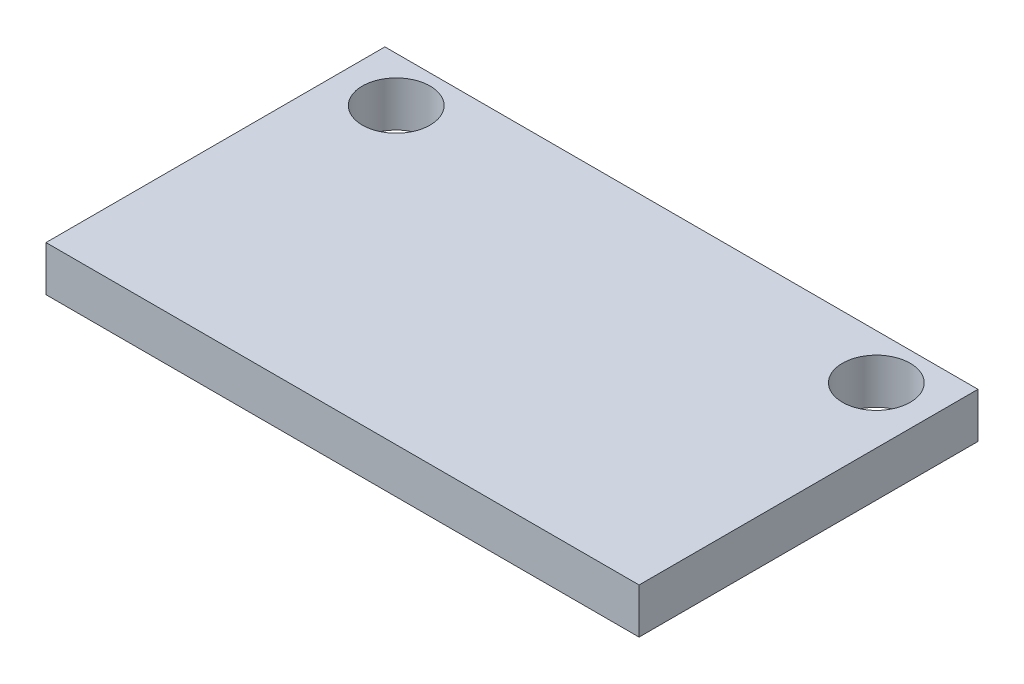
ISO-10303-21;
HEADER;
FILE_DESCRIPTION(('STEP AP214'),'2;1');
FILE_NAME('part.step','',(''),(''),'','','');
FILE_SCHEMA(('AUTOMOTIVE_DESIGN { 1 0 10303 214 1 1 1 1 }'));
ENDSEC;
DATA;
#1=APPLICATION_CONTEXT('core data for automotive mechanical design processes');
#2=APPLICATION_PROTOCOL_DEFINITION('international standard','automotive_design',2000,#1);
#3=PRODUCT_CONTEXT('',#1,'mechanical');
#4=PRODUCT('Part','Part','',(#3));
#5=PRODUCT_RELATED_PRODUCT_CATEGORY('part','',(#4));
#6=PRODUCT_DEFINITION_FORMATION('','',#4);
#7=PRODUCT_DEFINITION_CONTEXT('part definition',#1,'design');
#8=PRODUCT_DEFINITION('design','',#6,#7);
#9=PRODUCT_DEFINITION_SHAPE('','',#8);
#10=(LENGTH_UNIT() NAMED_UNIT(*) SI_UNIT(.MILLI.,.METRE.));
#11=(NAMED_UNIT(*) PLANE_ANGLE_UNIT() SI_UNIT($,.RADIAN.));
#12=(NAMED_UNIT(*) SI_UNIT($,.STERADIAN.) SOLID_ANGLE_UNIT());
#13=UNCERTAINTY_MEASURE_WITH_UNIT(LENGTH_MEASURE(1.E-05),#10,'distance_accuracy_value','');
#14=(GEOMETRIC_REPRESENTATION_CONTEXT(3) GLOBAL_UNCERTAINTY_ASSIGNED_CONTEXT((#13)) GLOBAL_UNIT_ASSIGNED_CONTEXT((#10,
#11,#12)) REPRESENTATION_CONTEXT('',''));
#15=CARTESIAN_POINT('',(0.,0.,0.));
#16=DIRECTION('',(0.,0.,1.));
#17=DIRECTION('',(1.,0.,0.));
#18=AXIS2_PLACEMENT_3D('',#15,#16,#17);
#19=CARTESIAN_POINT('',(0.,1.,0.));
#20=DIRECTION('',(0.,1.,0.));
#21=DIRECTION('',(0.,0.,1.));
#22=AXIS2_PLACEMENT_3D('',#19,#20,#21);
#23=PLANE('',#22);
#24=CARTESIAN_POINT('',(-10.625,1.,-5.5));
#25=DIRECTION('',(0.,1.,0.));
#26=DIRECTION('',(0.,0.,1.));
#27=AXIS2_PLACEMENT_3D('',#24,#25,#26);
#28=CIRCLE('',#27,1.5);
#29=CARTESIAN_POINT('',(-10.625,1.,-4.));
#30=VERTEX_POINT('',#29);
#31=EDGE_CURVE('E100',#30,#30,#28,.T.);
#32=ORIENTED_EDGE('',*,*,#31,.F.);
#33=EDGE_LOOP('',(#32));
#34=FACE_BOUND('',#33,.T.);
#35=DIRECTION('',(0.,0.,-1.));
#36=VECTOR('',#35,1.);
#37=CARTESIAN_POINT('',(13.125,1.,-7.5));
#38=LINE('',#37,#36);
#39=CARTESIAN_POINT('',(13.125,1.,7.5));
#40=VERTEX_POINT('',#39);
#41=CARTESIAN_POINT('',(13.125,1.,-7.5));
#42=VERTEX_POINT('',#41);
#43=EDGE_CURVE('E85',#40,#42,#38,.T.);
#44=ORIENTED_EDGE('',*,*,#43,.T.);
#45=DIRECTION('',(-1.,0.,0.));
#46=VECTOR('',#45,1.);
#47=CARTESIAN_POINT('',(-13.125,1.,-7.5));
#48=LINE('',#47,#46);
#49=CARTESIAN_POINT('',(-13.125,1.,-7.5));
#50=VERTEX_POINT('',#49);
#51=EDGE_CURVE('E80',#42,#50,#48,.T.);
#52=ORIENTED_EDGE('',*,*,#51,.T.);
#53=DIRECTION('',(0.,0.,1.));
#54=VECTOR('',#53,1.);
#55=CARTESIAN_POINT('',(-13.125,1.,-7.5));
#56=LINE('',#55,#54);
#57=CARTESIAN_POINT('',(-13.125,1.,7.5));
#58=VERTEX_POINT('',#57);
#59=EDGE_CURVE('E83',#50,#58,#56,.T.);
#60=ORIENTED_EDGE('',*,*,#59,.T.);
#61=DIRECTION('',(1.,0.,0.));
#62=VECTOR('',#61,1.);
#63=CARTESIAN_POINT('',(-13.125,1.,7.5));
#64=LINE('',#63,#62);
#65=EDGE_CURVE('E50',#58,#40,#64,.T.);
#66=ORIENTED_EDGE('',*,*,#65,.T.);
#67=EDGE_LOOP('',(#44,#52,#60,#66));
#68=FACE_BOUND('',#67,.T.);
#69=CARTESIAN_POINT('',(10.625,1.,-5.5));
#70=DIRECTION('',(0.,1.,0.));
#71=DIRECTION('',(0.,0.,1.));
#72=AXIS2_PLACEMENT_3D('',#69,#70,#71);
#73=CIRCLE('',#72,1.5);
#74=CARTESIAN_POINT('',(10.625,1.,-4.));
#75=VERTEX_POINT('',#74);
#76=EDGE_CURVE('E115',#75,#75,#73,.T.);
#77=ORIENTED_EDGE('',*,*,#76,.F.);
#78=EDGE_LOOP('',(#77));
#79=FACE_BOUND('',#78,.T.);
#80=ADVANCED_FACE('F33',(#34,#68,#79),#23,.T.);
#81=CARTESIAN_POINT('',(0.,-1.,0.));
#82=DIRECTION('',(0.,1.,0.));
#83=DIRECTION('',(0.,0.,1.));
#84=AXIS2_PLACEMENT_3D('',#81,#82,#83);
#85=PLANE('',#84);
#86=DIRECTION('',(0.,0.,-1.));
#87=VECTOR('',#86,1.);
#88=CARTESIAN_POINT('',(13.125,-1.,-7.5));
#89=LINE('',#88,#87);
#90=CARTESIAN_POINT('',(13.125,-1.,7.5));
#91=VERTEX_POINT('',#90);
#92=CARTESIAN_POINT('',(13.125,-1.,-7.5));
#93=VERTEX_POINT('',#92);
#94=EDGE_CURVE('E97',#91,#93,#89,.T.);
#95=ORIENTED_EDGE('',*,*,#94,.F.);
#96=DIRECTION('',(1.,0.,0.));
#97=VECTOR('',#96,1.);
#98=CARTESIAN_POINT('',(-13.125,-1.,7.5));
#99=LINE('',#98,#97);
#100=CARTESIAN_POINT('',(-13.125,-1.,7.5));
#101=VERTEX_POINT('',#100);
#102=EDGE_CURVE('E73',#101,#91,#99,.T.);
#103=ORIENTED_EDGE('',*,*,#102,.F.);
#104=DIRECTION('',(0.,0.,1.));
#105=VECTOR('',#104,1.);
#106=CARTESIAN_POINT('',(-13.125,-1.,-7.5));
#107=LINE('',#106,#105);
#108=CARTESIAN_POINT('',(-13.125,-1.,-7.5));
#109=VERTEX_POINT('',#108);
#110=EDGE_CURVE('E67',#109,#101,#107,.T.);
#111=ORIENTED_EDGE('',*,*,#110,.F.);
#112=DIRECTION('',(-1.,0.,0.));
#113=VECTOR('',#112,1.);
#114=CARTESIAN_POINT('',(-13.125,-1.,-7.5));
#115=LINE('',#114,#113);
#116=EDGE_CURVE('E89',#93,#109,#115,.T.);
#117=ORIENTED_EDGE('',*,*,#116,.F.);
#118=EDGE_LOOP('',(#95,#103,#111,#117));
#119=FACE_BOUND('',#118,.T.);
#120=CARTESIAN_POINT('',(-10.625,-1.,-5.5));
#121=DIRECTION('',(0.,1.,0.));
#122=DIRECTION('',(0.,0.,1.));
#123=AXIS2_PLACEMENT_3D('',#120,#121,#122);
#124=CIRCLE('',#123,1.5);
#125=CARTESIAN_POINT('',(-10.625,-1.,-4.));
#126=VERTEX_POINT('',#125);
#127=EDGE_CURVE('E112',#126,#126,#124,.T.);
#128=ORIENTED_EDGE('',*,*,#127,.T.);
#129=EDGE_LOOP('',(#128));
#130=FACE_BOUND('',#129,.T.);
#131=CARTESIAN_POINT('',(10.625,-1.,-5.5));
#132=DIRECTION('',(0.,1.,0.));
#133=DIRECTION('',(0.,0.,1.));
#134=AXIS2_PLACEMENT_3D('',#131,#132,#133);
#135=CIRCLE('',#134,1.5);
#136=CARTESIAN_POINT('',(10.625,-1.,-4.));
#137=VERTEX_POINT('',#136);
#138=EDGE_CURVE('E118',#137,#137,#135,.T.);
#139=ORIENTED_EDGE('',*,*,#138,.T.);
#140=EDGE_LOOP('',(#139));
#141=FACE_BOUND('',#140,.T.);
#142=ADVANCED_FACE('F108',(#119,#130,#141),#85,.F.);
#143=CARTESIAN_POINT('',(13.125,1.,-7.5));
#144=DIRECTION('',(-1.,0.,0.));
#145=DIRECTION('',(0.,0.,1.));
#146=AXIS2_PLACEMENT_3D('',#143,#144,#145);
#147=PLANE('',#146);
#148=ORIENTED_EDGE('',*,*,#94,.T.);
#149=DIRECTION('',(0.,-1.,0.));
#150=VECTOR('',#149,1.);
#151=CARTESIAN_POINT('',(13.125,1.,-7.5));
#152=LINE('',#151,#150);
#153=EDGE_CURVE('E11',#42,#93,#152,.T.);
#154=ORIENTED_EDGE('',*,*,#153,.F.);
#155=ORIENTED_EDGE('',*,*,#43,.F.);
#156=DIRECTION('',(0.,-1.,0.));
#157=VECTOR('',#156,1.);
#158=CARTESIAN_POINT('',(13.125,1.,7.5));
#159=LINE('',#158,#157);
#160=EDGE_CURVE('E93',#40,#91,#159,.T.);
#161=ORIENTED_EDGE('',*,*,#160,.T.);
#162=EDGE_LOOP('',(#148,#154,#155,#161));
#163=FACE_BOUND('',#162,.T.);
#164=ADVANCED_FACE('F35',(#163),#147,.F.);
#165=CARTESIAN_POINT('',(-13.125,1.,-7.5));
#166=DIRECTION('',(0.,0.,1.));
#167=DIRECTION('',(1.,0.,0.));
#168=AXIS2_PLACEMENT_3D('',#165,#166,#167);
#169=PLANE('',#168);
#170=ORIENTED_EDGE('',*,*,#116,.T.);
#171=DIRECTION('',(0.,-1.,0.));
#172=VECTOR('',#171,1.);
#173=CARTESIAN_POINT('',(-13.125,1.,-7.5));
#174=LINE('',#173,#172);
#175=EDGE_CURVE('E42',#50,#109,#174,.T.);
#176=ORIENTED_EDGE('',*,*,#175,.F.);
#177=ORIENTED_EDGE('',*,*,#51,.F.);
#178=ORIENTED_EDGE('',*,*,#153,.T.);
#179=EDGE_LOOP('',(#170,#176,#177,#178));
#180=FACE_BOUND('',#179,.T.);
#181=ADVANCED_FACE('F88',(#180),#169,.F.);
#182=CARTESIAN_POINT('',(-13.125,1.,-7.5));
#183=DIRECTION('',(1.,0.,0.));
#184=DIRECTION('',(0.,0.,-1.));
#185=AXIS2_PLACEMENT_3D('',#182,#183,#184);
#186=PLANE('',#185);
#187=ORIENTED_EDGE('',*,*,#110,.T.);
#188=DIRECTION('',(0.,-1.,0.));
#189=VECTOR('',#188,1.);
#190=CARTESIAN_POINT('',(-13.125,1.,7.5));
#191=LINE('',#190,#189);
#192=EDGE_CURVE('E90',#58,#101,#191,.T.);
#193=ORIENTED_EDGE('',*,*,#192,.F.);
#194=ORIENTED_EDGE('',*,*,#59,.F.);
#195=ORIENTED_EDGE('',*,*,#175,.T.);
#196=EDGE_LOOP('',(#187,#193,#194,#195));
#197=FACE_BOUND('',#196,.T.);
#198=ADVANCED_FACE('F91',(#197),#186,.F.);
#199=CARTESIAN_POINT('',(-13.125,1.,7.5));
#200=DIRECTION('',(0.,0.,-1.));
#201=DIRECTION('',(-1.,0.,0.));
#202=AXIS2_PLACEMENT_3D('',#199,#200,#201);
#203=PLANE('',#202);
#204=ORIENTED_EDGE('',*,*,#102,.T.);
#205=ORIENTED_EDGE('',*,*,#160,.F.);
#206=ORIENTED_EDGE('',*,*,#65,.F.);
#207=ORIENTED_EDGE('',*,*,#192,.T.);
#208=EDGE_LOOP('',(#204,#205,#206,#207));
#209=FACE_BOUND('',#208,.T.);
#210=ADVANCED_FACE('F105',(#209),#203,.F.);
#211=CARTESIAN_POINT('',(-10.625,1.,-5.5));
#212=DIRECTION('',(0.,-1.,0.));
#213=DIRECTION('',(0.,0.,-1.));
#214=AXIS2_PLACEMENT_3D('',#211,#212,#213);
#215=CYLINDRICAL_SURFACE('',#214,1.5);
#216=ORIENTED_EDGE('',*,*,#31,.T.);
#217=EDGE_LOOP('',(#216));
#218=FACE_BOUND('',#217,.T.);
#219=ORIENTED_EDGE('',*,*,#127,.F.);
#220=EDGE_LOOP('',(#219));
#221=FACE_BOUND('',#220,.T.);
#222=ADVANCED_FACE('F135',(#218,#221),#215,.F.);
#223=CARTESIAN_POINT('',(10.625,1.,-5.5));
#224=DIRECTION('',(0.,-1.,0.));
#225=DIRECTION('',(0.,0.,-1.));
#226=AXIS2_PLACEMENT_3D('',#223,#224,#225);
#227=CYLINDRICAL_SURFACE('',#226,1.5);
#228=ORIENTED_EDGE('',*,*,#76,.T.);
#229=EDGE_LOOP('',(#228));
#230=FACE_BOUND('',#229,.T.);
#231=ORIENTED_EDGE('',*,*,#138,.F.);
#232=EDGE_LOOP('',(#231));
#233=FACE_BOUND('',#232,.T.);
#234=ADVANCED_FACE('F124',(#230,#233),#227,.F.);
#235=CLOSED_SHELL('',(#80,#142,#164,#181,#198,#210,#222,#234));
#236=MANIFOLD_SOLID_BREP('B2',#235);
#237=ADVANCED_BREP_SHAPE_REPRESENTATION('',(#18,#236),#14);
#238=SHAPE_DEFINITION_REPRESENTATION(#9,#237);
ENDSEC;
END-ISO-10303-21;
